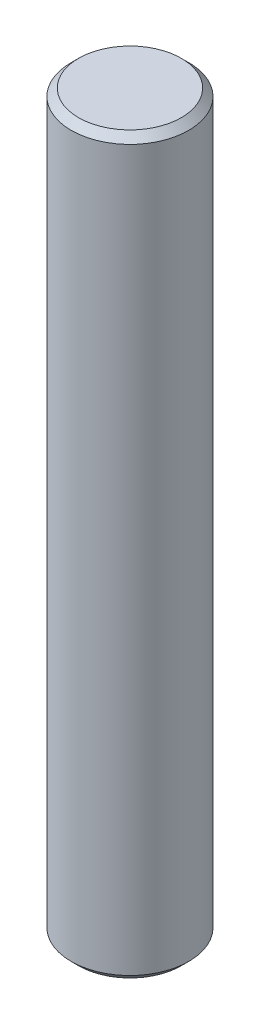
ISO-10303-21;
HEADER;
FILE_DESCRIPTION(('STEP AP214'),'2;1');
FILE_NAME('part.step','',(''),(''),'','','');
FILE_SCHEMA(('AUTOMOTIVE_DESIGN { 1 0 10303 214 1 1 1 1 }'));
ENDSEC;
DATA;
#1=APPLICATION_CONTEXT('core data for automotive mechanical design processes');
#2=APPLICATION_PROTOCOL_DEFINITION('international standard','automotive_design',2000,#1);
#3=PRODUCT_CONTEXT('',#1,'mechanical');
#4=PRODUCT('Part','Part','',(#3));
#5=PRODUCT_RELATED_PRODUCT_CATEGORY('part','',(#4));
#6=PRODUCT_DEFINITION_FORMATION('','',#4);
#7=PRODUCT_DEFINITION_CONTEXT('part definition',#1,'design');
#8=PRODUCT_DEFINITION('design','',#6,#7);
#9=PRODUCT_DEFINITION_SHAPE('','',#8);
#10=(LENGTH_UNIT() NAMED_UNIT(*) SI_UNIT(.MILLI.,.METRE.));
#11=(NAMED_UNIT(*) PLANE_ANGLE_UNIT() SI_UNIT($,.RADIAN.));
#12=(NAMED_UNIT(*) SI_UNIT($,.STERADIAN.) SOLID_ANGLE_UNIT());
#13=UNCERTAINTY_MEASURE_WITH_UNIT(LENGTH_MEASURE(1.E-05),#10,'distance_accuracy_value','');
#14=(GEOMETRIC_REPRESENTATION_CONTEXT(3) GLOBAL_UNCERTAINTY_ASSIGNED_CONTEXT((#13)) GLOBAL_UNIT_ASSIGNED_CONTEXT((#10,
#11,#12)) REPRESENTATION_CONTEXT('',''));
#15=CARTESIAN_POINT('',(0.,0.,0.));
#16=DIRECTION('',(0.,0.,1.));
#17=DIRECTION('',(1.,0.,0.));
#18=AXIS2_PLACEMENT_3D('',#15,#16,#17);
#19=CARTESIAN_POINT('',(0.,50.,0.));
#20=DIRECTION('',(0.,-1.,0.));
#21=DIRECTION('',(0.,0.,-1.));
#22=AXIS2_PLACEMENT_3D('',#19,#20,#21);
#23=CYLINDRICAL_SURFACE('',#22,4.);
#24=CARTESIAN_POINT('',(0.,0.5,0.));
#25=DIRECTION('',(0.,1.,0.));
#26=DIRECTION('',(0.,0.,1.));
#27=AXIS2_PLACEMENT_3D('',#24,#25,#26);
#28=CIRCLE('',#27,4.);
#29=CARTESIAN_POINT('',(0.,0.5,4.));
#30=VERTEX_POINT('',#29);
#31=EDGE_CURVE('E65',#30,#30,#28,.T.);
#32=ORIENTED_EDGE('',*,*,#31,.T.);
#33=EDGE_LOOP('',(#32));
#34=FACE_BOUND('',#33,.T.);
#35=CARTESIAN_POINT('',(0.,49.5,0.));
#36=DIRECTION('',(0.,1.,0.));
#37=DIRECTION('',(0.,0.,1.));
#38=AXIS2_PLACEMENT_3D('',#35,#36,#37);
#39=CIRCLE('',#38,4.);
#40=CARTESIAN_POINT('',(0.,49.5,4.));
#41=VERTEX_POINT('',#40);
#42=EDGE_CURVE('E71',#41,#41,#39,.F.);
#43=ORIENTED_EDGE('',*,*,#42,.T.);
#44=EDGE_LOOP('',(#43));
#45=FACE_BOUND('',#44,.T.);
#46=ADVANCED_FACE('F50',(#34,#45),#23,.T.);
#47=CARTESIAN_POINT('',(0.,50.,0.));
#48=DIRECTION('',(0.,1.,0.));
#49=DIRECTION('',(0.,0.,1.));
#50=AXIS2_PLACEMENT_3D('',#47,#48,#49);
#51=PLANE('',#50);
#52=CARTESIAN_POINT('',(0.,50.,0.));
#53=DIRECTION('',(0.,1.,0.));
#54=DIRECTION('',(0.,0.,1.));
#55=AXIS2_PLACEMENT_3D('',#52,#53,#54);
#56=CIRCLE('',#55,3.5);
#57=CARTESIAN_POINT('',(0.,50.,3.5));
#58=VERTEX_POINT('',#57);
#59=EDGE_CURVE('E12',#58,#58,#56,.T.);
#60=ORIENTED_EDGE('',*,*,#59,.T.);
#61=EDGE_LOOP('',(#60));
#62=FACE_BOUND('',#61,.T.);
#63=ADVANCED_FACE('F89',(#62),#51,.T.);
#64=CARTESIAN_POINT('',(0.,0.,0.));
#65=DIRECTION('',(0.,1.,0.));
#66=DIRECTION('',(0.,0.,1.));
#67=AXIS2_PLACEMENT_3D('',#64,#65,#66);
#68=PLANE('',#67);
#69=CARTESIAN_POINT('',(0.,0.,0.));
#70=DIRECTION('',(0.,1.,0.));
#71=DIRECTION('',(0.,0.,1.));
#72=AXIS2_PLACEMENT_3D('',#69,#70,#71);
#73=CIRCLE('',#72,3.5);
#74=CARTESIAN_POINT('',(0.,0.,3.5));
#75=VERTEX_POINT('',#74);
#76=EDGE_CURVE('E59',#75,#75,#73,.F.);
#77=ORIENTED_EDGE('',*,*,#76,.T.);
#78=EDGE_LOOP('',(#77));
#79=FACE_BOUND('',#78,.T.);
#80=ADVANCED_FACE('F86',(#79),#68,.F.);
#81=CARTESIAN_POINT('',(0.,0.5,0.));
#82=DIRECTION('',(0.,1.,0.));
#83=DIRECTION('',(0.,0.,1.));
#84=AXIS2_PLACEMENT_3D('',#81,#82,#83);
#85=CONICAL_SURFACE('',#84,4.,0.785398163397448);
#86=ORIENTED_EDGE('',*,*,#76,.F.);
#87=EDGE_LOOP('',(#86));
#88=FACE_BOUND('',#87,.T.);
#89=ORIENTED_EDGE('',*,*,#31,.F.);
#90=EDGE_LOOP('',(#89));
#91=FACE_BOUND('',#90,.T.);
#92=ADVANCED_FACE('F82',(#88,#91),#85,.T.);
#93=CARTESIAN_POINT('',(0.,50.,0.));
#94=DIRECTION('',(0.,-1.,0.));
#95=DIRECTION('',(0.,0.,-1.));
#96=AXIS2_PLACEMENT_3D('',#93,#94,#95);
#97=CONICAL_SURFACE('',#96,3.5,0.785398163397448);
#98=ORIENTED_EDGE('',*,*,#42,.F.);
#99=EDGE_LOOP('',(#98));
#100=FACE_BOUND('',#99,.T.);
#101=ORIENTED_EDGE('',*,*,#59,.F.);
#102=EDGE_LOOP('',(#101));
#103=FACE_BOUND('',#102,.T.);
#104=ADVANCED_FACE('F53',(#100,#103),#97,.T.);
#105=CLOSED_SHELL('',(#46,#63,#80,#92,#104));
#106=MANIFOLD_SOLID_BREP('B2',#105);
#107=ADVANCED_BREP_SHAPE_REPRESENTATION('',(#18,#106),#14);
#108=SHAPE_DEFINITION_REPRESENTATION(#9,#107);
ENDSEC;
END-ISO-10303-21;
